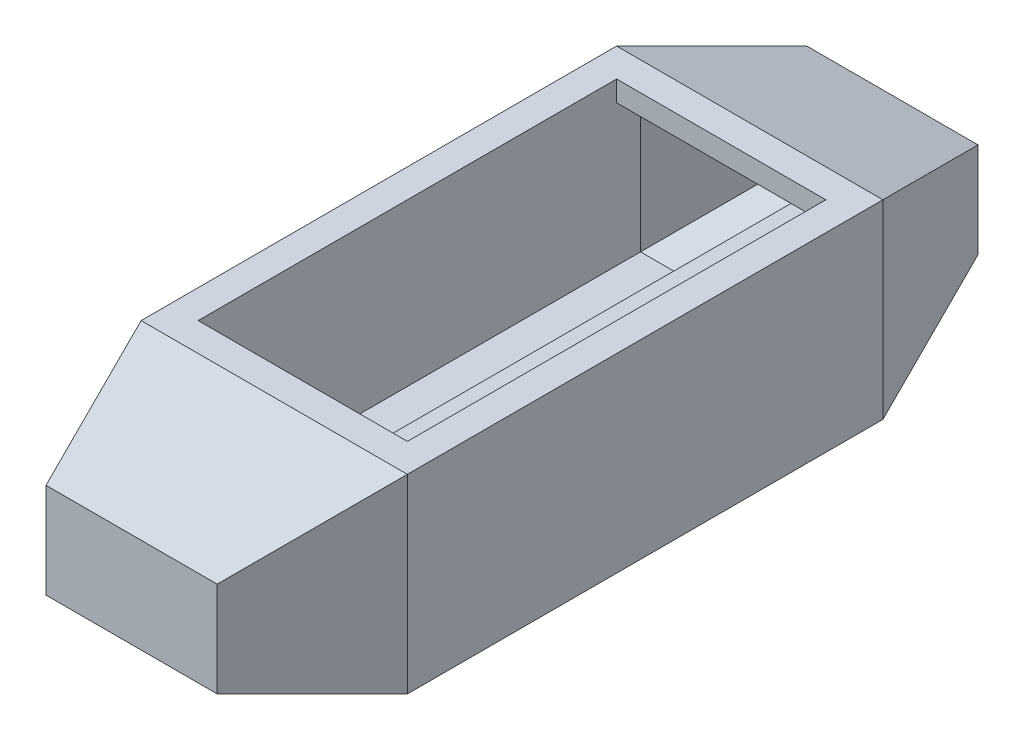
ISO-10303-21;
HEADER;
FILE_DESCRIPTION(('STEP AP214'),'2;1');
FILE_NAME('part.step','',(''),(''),'','','');
FILE_SCHEMA(('AUTOMOTIVE_DESIGN { 1 0 10303 214 1 1 1 1 }'));
ENDSEC;
DATA;
#1=APPLICATION_CONTEXT('core data for automotive mechanical design processes');
#2=APPLICATION_PROTOCOL_DEFINITION('international standard','automotive_design',2000,#1);
#3=PRODUCT_CONTEXT('',#1,'mechanical');
#4=PRODUCT('Part','Part','',(#3));
#5=PRODUCT_RELATED_PRODUCT_CATEGORY('part','',(#4));
#6=PRODUCT_DEFINITION_FORMATION('','',#4);
#7=PRODUCT_DEFINITION_CONTEXT('part definition',#1,'design');
#8=PRODUCT_DEFINITION('design','',#6,#7);
#9=PRODUCT_DEFINITION_SHAPE('','',#8);
#10=(LENGTH_UNIT() NAMED_UNIT(*) SI_UNIT(.MILLI.,.METRE.));
#11=(NAMED_UNIT(*) PLANE_ANGLE_UNIT() SI_UNIT($,.RADIAN.));
#12=(NAMED_UNIT(*) SI_UNIT($,.STERADIAN.) SOLID_ANGLE_UNIT());
#13=UNCERTAINTY_MEASURE_WITH_UNIT(LENGTH_MEASURE(1.E-05),#10,'distance_accuracy_value','');
#14=(GEOMETRIC_REPRESENTATION_CONTEXT(3) GLOBAL_UNCERTAINTY_ASSIGNED_CONTEXT((#13)) GLOBAL_UNIT_ASSIGNED_CONTEXT((#10,
#11,#12)) REPRESENTATION_CONTEXT('',''));
#15=CARTESIAN_POINT('',(0.,0.,0.));
#16=DIRECTION('',(0.,0.,1.));
#17=DIRECTION('',(1.,0.,0.));
#18=AXIS2_PLACEMENT_3D('',#15,#16,#17);
#19=CARTESIAN_POINT('',(-14.,10.,12.5));
#20=DIRECTION('',(0.,-1.,0.));
#21=DIRECTION('',(0.,0.,-1.));
#22=AXIS2_PLACEMENT_3D('',#19,#20,#21);
#23=PLANE('',#22);
#24=DIRECTION('',(0.,0.,-1.));
#25=VECTOR('',#24,1.);
#26=CARTESIAN_POINT('',(14.,10.,12.5));
#27=LINE('',#26,#25);
#28=CARTESIAN_POINT('',(14.,10.000000000006,12.500000000001));
#29=VERTEX_POINT('',#28);
#30=CARTESIAN_POINT('',(14.,10.000000000006,-37.500000000001));
#31=VERTEX_POINT('',#30);
#32=EDGE_CURVE('E673',#29,#31,#27,.T.);
#33=ORIENTED_EDGE('',*,*,#32,.T.);
#34=DIRECTION('',(1.,4.25932437468547E-13,-1.41977479156338E-13));
#35=VECTOR('',#34,1.);
#36=CARTESIAN_POINT('',(-6.03404286414252E-12,10.000000000006,-37.500000000002));
#37=LINE('',#36,#35);
#38=CARTESIAN_POINT('',(-13.9999999999997,10.,-37.5));
#39=VERTEX_POINT('',#38);
#40=EDGE_CURVE('E466',#31,#39,#37,.F.);
#41=ORIENTED_EDGE('',*,*,#40,.T.);
#42=DIRECTION('',(0.,0.,-1.));
#43=VECTOR('',#42,1.);
#44=CARTESIAN_POINT('',(-14.,10.,12.5));
#45=LINE('',#44,#43);
#46=CARTESIAN_POINT('',(-13.9999999999997,10.,12.5));
#47=VERTEX_POINT('',#46);
#48=EDGE_CURVE('E677',#47,#39,#45,.T.);
#49=ORIENTED_EDGE('',*,*,#48,.F.);
#50=DIRECTION('',(1.,4.25932437468547E-13,1.41977479156338E-13));
#51=VECTOR('',#50,1.);
#52=CARTESIAN_POINT('',(-6.03404286414252E-12,10.000000000006,12.500000000002));
#53=LINE('',#52,#51);
#54=EDGE_CURVE('E471',#29,#47,#53,.F.);
#55=ORIENTED_EDGE('',*,*,#54,.F.);
#56=EDGE_LOOP('',(#33,#41,#49,#55));
#57=FACE_BOUND('',#56,.T.);
#58=DIRECTION('',(0.,0.,-1.));
#59=VECTOR('',#58,1.);
#60=CARTESIAN_POINT('',(-11.,10.,12.5));
#61=LINE('',#60,#59);
#62=CARTESIAN_POINT('',(-11.,10.,9.500000000001));
#63=VERTEX_POINT('',#62);
#64=CARTESIAN_POINT('',(-11.,10.,-34.500000000001));
#65=VERTEX_POINT('',#64);
#66=EDGE_CURVE('E238',#63,#65,#61,.T.);
#67=ORIENTED_EDGE('',*,*,#66,.T.);
#68=DIRECTION('',(-1.,0.,0.));
#69=VECTOR('',#68,1.);
#70=CARTESIAN_POINT('',(11.,10.,-34.500000000001));
#71=LINE('',#70,#69);
#72=CARTESIAN_POINT('',(11.,10.,-34.500000000001));
#73=VERTEX_POINT('',#72);
#74=EDGE_CURVE('E236',#73,#65,#71,.T.);
#75=ORIENTED_EDGE('',*,*,#74,.F.);
#76=DIRECTION('',(0.,0.,-1.));
#77=VECTOR('',#76,1.);
#78=CARTESIAN_POINT('',(11.,10.,12.5));
#79=LINE('',#78,#77);
#80=CARTESIAN_POINT('',(11.,10.,9.500000000001));
#81=VERTEX_POINT('',#80);
#82=EDGE_CURVE('E231',#81,#73,#79,.T.);
#83=ORIENTED_EDGE('',*,*,#82,.F.);
#84=DIRECTION('',(1.,0.,0.));
#85=VECTOR('',#84,1.);
#86=CARTESIAN_POINT('',(11.,10.,9.500000000001));
#87=LINE('',#86,#85);
#88=EDGE_CURVE('E234',#63,#81,#87,.T.);
#89=ORIENTED_EDGE('',*,*,#88,.F.);
#90=EDGE_LOOP('',(#67,#75,#83,#89));
#91=FACE_BOUND('',#90,.T.);
#92=ADVANCED_FACE('F43',(#57,#91),#23,.F.);
#93=CARTESIAN_POINT('',(-14.,-10.,12.5));
#94=DIRECTION('',(0.,1.,0.));
#95=DIRECTION('',(0.,0.,1.));
#96=AXIS2_PLACEMENT_3D('',#93,#94,#95);
#97=PLANE('',#96);
#98=DIRECTION('',(1.,-4.25816789236066E-13,-1.41938929745199E-13));
#99=VECTOR('',#98,1.);
#100=CARTESIAN_POINT('',(-6.03240451417282E-12,-9.99999999999404,-37.499999999998));
#101=LINE('',#100,#99);
#102=CARTESIAN_POINT('',(-14.,-9.99999999999404,-37.499999999999));
#103=VERTEX_POINT('',#102);
#104=CARTESIAN_POINT('',(-1.49999999999999,-10.,-37.4999999999801));
#105=VERTEX_POINT('',#104);
#106=EDGE_CURVE('E643',#103,#105,#101,.T.);
#107=ORIENTED_EDGE('',*,*,#106,.T.);
#108=DIRECTION('',(0.,0.,-1.));
#109=VECTOR('',#108,1.);
#110=CARTESIAN_POINT('',(-1.5,-10.,27.4999999999876));
#111=LINE('',#110,#109);
#112=CARTESIAN_POINT('',(-1.5,-10.,12.4999999999801));
#113=VERTEX_POINT('',#112);
#114=EDGE_CURVE('E365',#113,#105,#111,.T.);
#115=ORIENTED_EDGE('',*,*,#114,.F.);
#116=DIRECTION('',(1.,-4.25816789236066E-13,1.41938929745199E-13));
#117=VECTOR('',#116,1.);
#118=CARTESIAN_POINT('',(-6.03240451417282E-12,-9.99999999999404,12.499999999998));
#119=LINE('',#118,#117);
#120=CARTESIAN_POINT('',(-14.,-9.99999999999404,12.499999999999));
#121=VERTEX_POINT('',#120);
#122=EDGE_CURVE('E501',#121,#113,#119,.T.);
#123=ORIENTED_EDGE('',*,*,#122,.F.);
#124=DIRECTION('',(0.,0.,-1.));
#125=VECTOR('',#124,1.);
#126=CARTESIAN_POINT('',(-14.,-10.,12.5));
#127=LINE('',#126,#125);
#128=EDGE_CURVE('E672',#121,#103,#127,.T.);
#129=ORIENTED_EDGE('',*,*,#128,.T.);
#130=EDGE_LOOP('',(#107,#115,#123,#129));
#131=FACE_BOUND('',#130,.T.);
#132=ADVANCED_FACE('F683',(#131),#97,.F.);
#133=CARTESIAN_POINT('',(-6.03240451417282E-12,-12.7499999999927,4.2499999999929));
#134=DIRECTION('',(4.48850306641896E-13,0.948683298050618,-0.316227766016525));
#135=DIRECTION('',(0.,0.316227766016525,0.948683298050618));
#136=AXIS2_PLACEMENT_3D('',#133,#134,#135);
#137=PLANE('',#136);
#138=ORIENTED_EDGE('',*,*,#122,.T.);
#139=DIRECTION('',(0.,0.316227766016525,0.948683298050618));
#140=VECTOR('',#139,1.);
#141=CARTESIAN_POINT('',(-1.5,-12.7499999999921,4.24999999999268));
#142=LINE('',#141,#140);
#143=CARTESIAN_POINT('',(-1.5,-5.,27.4999999999876));
#144=VERTEX_POINT('',#143);
#145=EDGE_CURVE('E376',#113,#144,#142,.T.);
#146=ORIENTED_EDGE('',*,*,#145,.T.);
#147=DIRECTION('',(1.,0.,1.4193892974548E-12));
#148=VECTOR('',#147,1.);
#149=CARTESIAN_POINT('',(-9.0000000000213,-4.99999999999874,27.4999999999876));
#150=LINE('',#149,#148);
#151=CARTESIAN_POINT('',(-9.0000000000213,-4.99999999999874,27.4999999999876));
#152=VERTEX_POINT('',#151);
#153=EDGE_CURVE('E385',#152,#144,#150,.T.);
#154=ORIENTED_EDGE('',*,*,#153,.F.);
#155=DIRECTION('',(0.301511344576792,0.301511344578153,0.904534033733485));
#156=VECTOR('',#155,1.);
#157=CARTESIAN_POINT('',(-14.,-10.,12.5));
#158=LINE('',#157,#156);
#159=EDGE_CURVE('E465',#121,#152,#158,.T.);
#160=ORIENTED_EDGE('',*,*,#159,.F.);
#161=EDGE_LOOP('',(#138,#146,#154,#160));
#162=FACE_BOUND('',#161,.T.);
#163=ADVANCED_FACE('F721',(#162),#137,.F.);
#164=CARTESIAN_POINT('',(-6.03240451417282E-12,-12.7499999999927,-29.2499999999929));
#165=DIRECTION('',(4.48850306641896E-13,0.948683298050618,0.316227766016525));
#166=DIRECTION('',(0.,0.316227766016525,-0.948683298050618));
#167=AXIS2_PLACEMENT_3D('',#164,#165,#166);
#168=PLANE('',#167);
#169=DIRECTION('',(1.,0.,-1.4193892974548E-12));
#170=VECTOR('',#169,1.);
#171=CARTESIAN_POINT('',(-9.0000000000213,-4.99999999999874,-52.4999999999877));
#172=LINE('',#171,#170);
#173=CARTESIAN_POINT('',(-9.0000000000213,-4.99999999999874,-52.4999999999877));
#174=VERTEX_POINT('',#173);
#175=CARTESIAN_POINT('',(-1.5,-5.00000000000033,-52.4999999999935));
#176=VERTEX_POINT('',#175);
#177=EDGE_CURVE('E597',#174,#176,#172,.T.);
#178=ORIENTED_EDGE('',*,*,#177,.T.);
#179=DIRECTION('',(0.,-0.316227766016525,0.948683298050618));
#180=VECTOR('',#179,1.);
#181=CARTESIAN_POINT('',(-1.49999999999999,-12.7499999999921,-29.2499999999927));
#182=LINE('',#181,#180);
#183=EDGE_CURVE('E12',#176,#105,#182,.T.);
#184=ORIENTED_EDGE('',*,*,#183,.T.);
#185=ORIENTED_EDGE('',*,*,#106,.F.);
#186=DIRECTION('',(0.301511344576792,0.301511344578153,-0.904534033733485));
#187=VECTOR('',#186,1.);
#188=CARTESIAN_POINT('',(-14.,-10.,-37.5));
#189=LINE('',#188,#187);
#190=EDGE_CURVE('E587',#103,#174,#189,.T.);
#191=ORIENTED_EDGE('',*,*,#190,.T.);
#192=EDGE_LOOP('',(#178,#184,#185,#191));
#193=FACE_BOUND('',#192,.T.);
#194=ADVANCED_FACE('F680',(#193),#168,.F.);
#195=CARTESIAN_POINT('',(-14.,10.,12.5));
#196=DIRECTION('',(1.,0.,0.));
#197=DIRECTION('',(0.,0.,-1.));
#198=AXIS2_PLACEMENT_3D('',#195,#196,#197);
#199=PLANE('',#198);
#200=ORIENTED_EDGE('',*,*,#48,.T.);
#201=DIRECTION('',(0.,1.,0.));
#202=VECTOR('',#201,1.);
#203=CARTESIAN_POINT('',(-13.9999999999997,4.61367055669139E-13,-37.4999999999999));
#204=LINE('',#203,#202);
#205=EDGE_CURVE('E586',#39,#103,#204,.F.);
#206=ORIENTED_EDGE('',*,*,#205,.T.);
#207=ORIENTED_EDGE('',*,*,#128,.F.);
#208=DIRECTION('',(0.,1.,0.));
#209=VECTOR('',#208,1.);
#210=CARTESIAN_POINT('',(-13.9999999999997,4.61367055669139E-13,12.4999999999999));
#211=LINE('',#210,#209);
#212=EDGE_CURVE('E486',#47,#121,#211,.F.);
#213=ORIENTED_EDGE('',*,*,#212,.F.);
#214=EDGE_LOOP('',(#200,#206,#207,#213));
#215=FACE_BOUND('',#214,.T.);
#216=ADVANCED_FACE('F45',(#215),#199,.F.);
#217=CARTESIAN_POINT('',(1.5,-10.,12.4999999999801));
#218=VERTEX_POINT('',#217);
#219=CARTESIAN_POINT('',(14.0000000000003,-10.,12.5));
#220=VERTEX_POINT('',#219);
#221=EDGE_CURVE('E498',#218,#220,#119,.T.);
#222=ORIENTED_EDGE('',*,*,#221,.F.);
#223=DIRECTION('',(0.,0.,1.));
#224=VECTOR('',#223,1.);
#225=CARTESIAN_POINT('',(1.5,-10.,27.4999999999876));
#226=LINE('',#225,#224);
#227=CARTESIAN_POINT('',(1.49999999999999,-10.,-37.4999999999801));
#228=VERTEX_POINT('',#227);
#229=EDGE_CURVE('E369',#228,#218,#226,.T.);
#230=ORIENTED_EDGE('',*,*,#229,.F.);
#231=CARTESIAN_POINT('',(14.0000000000003,-10.,-37.5));
#232=VERTEX_POINT('',#231);
#233=EDGE_CURVE('E652',#228,#232,#101,.T.);
#234=ORIENTED_EDGE('',*,*,#233,.T.);
#235=DIRECTION('',(0.,0.,-1.));
#236=VECTOR('',#235,1.);
#237=CARTESIAN_POINT('',(14.,-10.,12.5));
#238=LINE('',#237,#236);
#239=EDGE_CURVE('E666',#220,#232,#238,.T.);
#240=ORIENTED_EDGE('',*,*,#239,.F.);
#241=EDGE_LOOP('',(#222,#230,#234,#240));
#242=FACE_BOUND('',#241,.T.);
#243=ADVANCED_FACE('F665',(#242),#97,.F.);
#244=CARTESIAN_POINT('',(14.,10.,12.5));
#245=DIRECTION('',(-1.,0.,0.));
#246=DIRECTION('',(0.,-1.,0.));
#247=AXIS2_PLACEMENT_3D('',#244,#245,#246);
#248=PLANE('',#247);
#249=ORIENTED_EDGE('',*,*,#239,.T.);
#250=DIRECTION('',(0.,1.,0.));
#251=VECTOR('',#250,1.);
#252=CARTESIAN_POINT('',(14.0000000000003,4.575853584948E-13,-37.5000000000001));
#253=LINE('',#252,#251);
#254=EDGE_CURVE('E651',#232,#31,#253,.T.);
#255=ORIENTED_EDGE('',*,*,#254,.T.);
#256=ORIENTED_EDGE('',*,*,#32,.F.);
#257=DIRECTION('',(0.,1.,0.));
#258=VECTOR('',#257,1.);
#259=CARTESIAN_POINT('',(14.0000000000003,4.575853584948E-13,12.5000000000001));
#260=LINE('',#259,#258);
#261=EDGE_CURVE('E671',#220,#29,#260,.T.);
#262=ORIENTED_EDGE('',*,*,#261,.F.);
#263=EDGE_LOOP('',(#249,#255,#256,#262));
#264=FACE_BOUND('',#263,.T.);
#265=ADVANCED_FACE('F418',(#264),#248,.F.);
#266=CARTESIAN_POINT('',(-3.9033205680007E-11,2.32799890476087E-12,27.5));
#267=DIRECTION('',(-1.4193892974548E-12,0.,1.));
#268=DIRECTION('',(1.,0.,1.4193892974548E-12));
#269=AXIS2_PLACEMENT_3D('',#266,#267,#268);
#270=PLANE('',#269);
#271=DIRECTION('',(0.,-1.,0.));
#272=VECTOR('',#271,1.);
#273=CARTESIAN_POINT('',(-9.0000000000213,5.00000000000127,27.4999999999868));
#274=LINE('',#273,#272);
#275=CARTESIAN_POINT('',(-9.0000000000213,5.00000000000127,27.4999999999868));
#276=VERTEX_POINT('',#275);
#277=EDGE_CURVE('E453',#276,#152,#274,.T.);
#278=ORIENTED_EDGE('',*,*,#277,.T.);
#279=ORIENTED_EDGE('',*,*,#153,.T.);
#280=DIRECTION('',(1.,0.,0.));
#281=VECTOR('',#280,1.);
#282=CARTESIAN_POINT('',(0.,-5.,27.4999999999876));
#283=LINE('',#282,#281);
#284=CARTESIAN_POINT('',(1.5,-5.,27.4999999999876));
#285=VERTEX_POINT('',#284);
#286=EDGE_CURVE('E726',#285,#144,#283,.F.);
#287=ORIENTED_EDGE('',*,*,#286,.F.);
#288=CARTESIAN_POINT('',(8.9999999999787,-4.99999999999874,27.5000000000132));
#289=VERTEX_POINT('',#288);
#290=EDGE_CURVE('E382',#285,#289,#150,.T.);
#291=ORIENTED_EDGE('',*,*,#290,.T.);
#292=DIRECTION('',(0.,1.,0.));
#293=VECTOR('',#292,1.);
#294=CARTESIAN_POINT('',(8.9999999999787,5.00000000000127,27.5000000000124));
#295=LINE('',#294,#293);
#296=CARTESIAN_POINT('',(8.9999999999787,5.00000000000127,27.5000000000124));
#297=VERTEX_POINT('',#296);
#298=EDGE_CURVE('E388',#289,#297,#295,.T.);
#299=ORIENTED_EDGE('',*,*,#298,.T.);
#300=DIRECTION('',(-1.,0.,-1.41977479156057E-12));
#301=VECTOR('',#300,1.);
#302=CARTESIAN_POINT('',(-9.0000000000213,5.00000000000127,27.4999999999868));
#303=LINE('',#302,#301);
#304=EDGE_CURVE('E443',#297,#276,#303,.T.);
#305=ORIENTED_EDGE('',*,*,#304,.T.);
#306=EDGE_LOOP('',(#278,#279,#287,#291,#299,#305));
#307=FACE_BOUND('',#306,.T.);
#308=ADVANCED_FACE('F407',(#307),#270,.T.);
#309=CARTESIAN_POINT('',(-6.03404286414252E-12,12.7500000000073,4.2500000000071));
#310=DIRECTION('',(4.48972210582666E-13,-0.94868329805041,-0.316227766017151));
#311=DIRECTION('',(0.,0.316227766017151,-0.94868329805041));
#312=AXIS2_PLACEMENT_3D('',#309,#310,#311);
#313=PLANE('',#312);
#314=DIRECTION('',(0.30151134457682,-0.301511344578028,0.904534033733517));
#315=VECTOR('',#314,1.);
#316=CARTESIAN_POINT('',(-14.,10.,12.5));
#317=LINE('',#316,#315);
#318=EDGE_CURVE('E446',#47,#276,#317,.T.);
#319=ORIENTED_EDGE('',*,*,#318,.T.);
#320=ORIENTED_EDGE('',*,*,#304,.F.);
#321=DIRECTION('',(-0.301511344578735,-0.301511344577374,0.904534033733097));
#322=VECTOR('',#321,1.);
#323=CARTESIAN_POINT('',(14.,10.,12.5));
#324=LINE('',#323,#322);
#325=EDGE_CURVE('E472',#29,#297,#324,.T.);
#326=ORIENTED_EDGE('',*,*,#325,.F.);
#327=ORIENTED_EDGE('',*,*,#54,.T.);
#328=EDGE_LOOP('',(#319,#320,#326,#327));
#329=FACE_BOUND('',#328,.T.);
#330=ADVANCED_FACE('F417',(#329),#313,.F.);
#331=CARTESIAN_POINT('',(16.3500000000019,4.575853584948E-13,5.45000000001952));
#332=DIRECTION('',(-0.948683298050185,0.,-0.316227766017824));
#333=DIRECTION('',(-0.316227766017824,0.,0.948683298050185));
#334=AXIS2_PLACEMENT_3D('',#331,#332,#333);
#335=PLANE('',#334);
#336=ORIENTED_EDGE('',*,*,#325,.T.);
#337=ORIENTED_EDGE('',*,*,#298,.F.);
#338=DIRECTION('',(-0.301511344578707,0.301511344577499,0.904534033733065));
#339=VECTOR('',#338,1.);
#340=CARTESIAN_POINT('',(14.,-10.,12.5));
#341=LINE('',#340,#339);
#342=EDGE_CURVE('E481',#220,#289,#341,.T.);
#343=ORIENTED_EDGE('',*,*,#342,.F.);
#344=ORIENTED_EDGE('',*,*,#261,.T.);
#345=EDGE_LOOP('',(#336,#337,#343,#344));
#346=FACE_BOUND('',#345,.T.);
#347=ADVANCED_FACE('F692',(#346),#335,.F.);
#348=CARTESIAN_POINT('',(-16.3499999999981,4.61367055669139E-13,5.44999999998048));
#349=DIRECTION('',(0.948683298050842,0.,-0.316227766015852));
#350=DIRECTION('',(-0.316227766015852,0.,-0.948683298050843));
#351=AXIS2_PLACEMENT_3D('',#348,#349,#350);
#352=PLANE('',#351);
#353=ORIENTED_EDGE('',*,*,#159,.T.);
#354=ORIENTED_EDGE('',*,*,#277,.F.);
#355=ORIENTED_EDGE('',*,*,#318,.F.);
#356=ORIENTED_EDGE('',*,*,#212,.T.);
#357=EDGE_LOOP('',(#353,#354,#355,#356));
#358=FACE_BOUND('',#357,.T.);
#359=ADVANCED_FACE('F462',(#358),#352,.F.);
#360=ORIENTED_EDGE('',*,*,#290,.F.);
#361=DIRECTION('',(0.,-0.316227766016525,-0.948683298050618));
#362=VECTOR('',#361,1.);
#363=CARTESIAN_POINT('',(1.5,-12.7499999999934,4.24999999999311));
#364=LINE('',#363,#362);
#365=EDGE_CURVE('E381',#285,#218,#364,.T.);
#366=ORIENTED_EDGE('',*,*,#365,.T.);
#367=ORIENTED_EDGE('',*,*,#221,.T.);
#368=ORIENTED_EDGE('',*,*,#342,.T.);
#369=EDGE_LOOP('',(#360,#366,#367,#368));
#370=FACE_BOUND('',#369,.T.);
#371=ADVANCED_FACE('F619',(#370),#137,.F.);
#372=CARTESIAN_POINT('',(-3.9033205680007E-11,2.32799890476087E-12,-52.5));
#373=DIRECTION('',(-1.4193892974548E-12,0.,-1.));
#374=DIRECTION('',(1.,0.,-1.4193892974548E-12));
#375=AXIS2_PLACEMENT_3D('',#372,#373,#374);
#376=PLANE('',#375);
#377=DIRECTION('',(0.,-1.,0.));
#378=VECTOR('',#377,1.);
#379=CARTESIAN_POINT('',(-9.0000000000213,5.00000000000127,-52.4999999999868));
#380=LINE('',#379,#378);
#381=CARTESIAN_POINT('',(-9.0000000000213,5.00000000000127,-52.4999999999868));
#382=VERTEX_POINT('',#381);
#383=EDGE_CURVE('E380',#382,#174,#380,.T.);
#384=ORIENTED_EDGE('',*,*,#383,.F.);
#385=DIRECTION('',(-1.,0.,1.41977479156057E-12));
#386=VECTOR('',#385,1.);
#387=CARTESIAN_POINT('',(-9.0000000000213,5.00000000000127,-52.4999999999868));
#388=LINE('',#387,#386);
#389=CARTESIAN_POINT('',(8.9999999999787,5.00000000000127,-52.5000000000124));
#390=VERTEX_POINT('',#389);
#391=EDGE_CURVE('E581',#390,#382,#388,.T.);
#392=ORIENTED_EDGE('',*,*,#391,.F.);
#393=DIRECTION('',(0.,1.,0.));
#394=VECTOR('',#393,1.);
#395=CARTESIAN_POINT('',(8.9999999999787,5.00000000000127,-52.5000000000124));
#396=LINE('',#395,#394);
#397=CARTESIAN_POINT('',(8.9999999999787,-4.99999999999874,-52.5000000000132));
#398=VERTEX_POINT('',#397);
#399=EDGE_CURVE('E533',#398,#390,#396,.T.);
#400=ORIENTED_EDGE('',*,*,#399,.F.);
#401=CARTESIAN_POINT('',(1.49999999999999,-5.,-52.4999999999877));
#402=VERTEX_POINT('',#401);
#403=EDGE_CURVE('E512',#402,#398,#172,.T.);
#404=ORIENTED_EDGE('',*,*,#403,.F.);
#405=DIRECTION('',(1.,0.,0.));
#406=VECTOR('',#405,1.);
#407=CARTESIAN_POINT('',(0.,-5.,-52.4999999999877));
#408=LINE('',#407,#406);
#409=EDGE_CURVE('E389',#176,#402,#408,.T.);
#410=ORIENTED_EDGE('',*,*,#409,.F.);
#411=ORIENTED_EDGE('',*,*,#177,.F.);
#412=EDGE_LOOP('',(#384,#392,#400,#404,#410,#411));
#413=FACE_BOUND('',#412,.T.);
#414=ADVANCED_FACE('F610',(#413),#376,.T.);
#415=CARTESIAN_POINT('',(-6.03404286414252E-12,12.7500000000073,-29.2500000000071));
#416=DIRECTION('',(4.48972210582666E-13,-0.94868329805041,0.316227766017151));
#417=DIRECTION('',(0.,0.316227766017151,0.94868329805041));
#418=AXIS2_PLACEMENT_3D('',#415,#416,#417);
#419=PLANE('',#418);
#420=DIRECTION('',(0.30151134457682,-0.301511344578028,-0.904534033733517));
#421=VECTOR('',#420,1.);
#422=CARTESIAN_POINT('',(-14.,10.,-37.5));
#423=LINE('',#422,#421);
#424=EDGE_CURVE('E593',#39,#382,#423,.T.);
#425=ORIENTED_EDGE('',*,*,#424,.F.);
#426=ORIENTED_EDGE('',*,*,#40,.F.);
#427=DIRECTION('',(-0.301511344578735,-0.301511344577374,-0.904534033733097));
#428=VECTOR('',#427,1.);
#429=CARTESIAN_POINT('',(14.,10.,-37.5));
#430=LINE('',#429,#428);
#431=EDGE_CURVE('E373',#31,#390,#430,.T.);
#432=ORIENTED_EDGE('',*,*,#431,.T.);
#433=ORIENTED_EDGE('',*,*,#391,.T.);
#434=EDGE_LOOP('',(#425,#426,#432,#433));
#435=FACE_BOUND('',#434,.T.);
#436=ADVANCED_FACE('F551',(#435),#419,.F.);
#437=CARTESIAN_POINT('',(16.3500000000019,4.575853584948E-13,-30.4500000000195));
#438=DIRECTION('',(-0.948683298050185,0.,0.316227766017824));
#439=DIRECTION('',(-0.316227766017824,0.,-0.948683298050185));
#440=AXIS2_PLACEMENT_3D('',#437,#438,#439);
#441=PLANE('',#440);
#442=ORIENTED_EDGE('',*,*,#431,.F.);
#443=ORIENTED_EDGE('',*,*,#254,.F.);
#444=DIRECTION('',(-0.301511344578707,0.301511344577499,-0.904534033733065));
#445=VECTOR('',#444,1.);
#446=CARTESIAN_POINT('',(14.,-10.,-37.5));
#447=LINE('',#446,#445);
#448=EDGE_CURVE('E584',#232,#398,#447,.T.);
#449=ORIENTED_EDGE('',*,*,#448,.T.);
#450=ORIENTED_EDGE('',*,*,#399,.T.);
#451=EDGE_LOOP('',(#442,#443,#449,#450));
#452=FACE_BOUND('',#451,.T.);
#453=ADVANCED_FACE('F541',(#452),#441,.F.);
#454=CARTESIAN_POINT('',(-16.3499999999981,4.61367055669139E-13,-30.4499999999805));
#455=DIRECTION('',(0.948683298050842,0.,0.316227766015852));
#456=DIRECTION('',(-0.316227766015852,0.,0.948683298050843));
#457=AXIS2_PLACEMENT_3D('',#454,#455,#456);
#458=PLANE('',#457);
#459=ORIENTED_EDGE('',*,*,#190,.F.);
#460=ORIENTED_EDGE('',*,*,#205,.F.);
#461=ORIENTED_EDGE('',*,*,#424,.T.);
#462=ORIENTED_EDGE('',*,*,#383,.T.);
#463=EDGE_LOOP('',(#459,#460,#461,#462));
#464=FACE_BOUND('',#463,.T.);
#465=ADVANCED_FACE('F550',(#464),#458,.F.);
#466=ORIENTED_EDGE('',*,*,#233,.F.);
#467=DIRECTION('',(0.,0.316227766016525,-0.948683298050618));
#468=VECTOR('',#467,1.);
#469=CARTESIAN_POINT('',(1.49999999999999,-12.7499999999934,-29.2499999999931));
#470=LINE('',#469,#468);
#471=EDGE_CURVE('E52',#228,#402,#470,.T.);
#472=ORIENTED_EDGE('',*,*,#471,.T.);
#473=ORIENTED_EDGE('',*,*,#403,.T.);
#474=ORIENTED_EDGE('',*,*,#448,.F.);
#475=EDGE_LOOP('',(#466,#472,#473,#474));
#476=FACE_BOUND('',#475,.T.);
#477=ADVANCED_FACE('F419',(#476),#168,.F.);
#478=CARTESIAN_POINT('',(-1.5,-5.,27.4999999999876));
#479=DIRECTION('',(-1.,0.,0.));
#480=DIRECTION('',(0.,0.,1.));
#481=AXIS2_PLACEMENT_3D('',#478,#479,#480);
#482=PLANE('',#481);
#483=ORIENTED_EDGE('',*,*,#114,.T.);
#484=ORIENTED_EDGE('',*,*,#183,.F.);
#485=DIRECTION('',(0.,0.,-1.));
#486=VECTOR('',#485,1.);
#487=CARTESIAN_POINT('',(-1.5,-5.,27.4999999999876));
#488=LINE('',#487,#486);
#489=EDGE_CURVE('E68',#144,#176,#488,.T.);
#490=ORIENTED_EDGE('',*,*,#489,.F.);
#491=ORIENTED_EDGE('',*,*,#145,.F.);
#492=EDGE_LOOP('',(#483,#484,#490,#491));
#493=FACE_BOUND('',#492,.T.);
#494=ADVANCED_FACE('F620',(#493),#482,.F.);
#495=CARTESIAN_POINT('',(1.5,-5.,27.4999999999876));
#496=DIRECTION('',(1.,0.,0.));
#497=DIRECTION('',(0.,0.,-1.));
#498=AXIS2_PLACEMENT_3D('',#495,#496,#497);
#499=PLANE('',#498);
#500=DIRECTION('',(0.,0.,1.));
#501=VECTOR('',#500,1.);
#502=CARTESIAN_POINT('',(1.5,-5.,27.4999999999876));
#503=LINE('',#502,#501);
#504=EDGE_CURVE('E728',#402,#285,#503,.T.);
#505=ORIENTED_EDGE('',*,*,#504,.F.);
#506=ORIENTED_EDGE('',*,*,#471,.F.);
#507=ORIENTED_EDGE('',*,*,#229,.T.);
#508=ORIENTED_EDGE('',*,*,#365,.F.);
#509=EDGE_LOOP('',(#505,#506,#507,#508));
#510=FACE_BOUND('',#509,.T.);
#511=ADVANCED_FACE('F742',(#510),#499,.F.);
#512=CARTESIAN_POINT('',(0.,-5.,0.));
#513=DIRECTION('',(0.,-1.,0.));
#514=DIRECTION('',(0.,0.,-1.));
#515=AXIS2_PLACEMENT_3D('',#512,#513,#514);
#516=PLANE('',#515);
#517=ORIENTED_EDGE('',*,*,#489,.T.);
#518=ORIENTED_EDGE('',*,*,#409,.T.);
#519=ORIENTED_EDGE('',*,*,#504,.T.);
#520=ORIENTED_EDGE('',*,*,#286,.T.);
#521=EDGE_LOOP('',(#517,#518,#519,#520));
#522=FACE_BOUND('',#521,.T.);
#523=ADVANCED_FACE('F727',(#522),#516,.T.);
#524=CARTESIAN_POINT('',(-14.,-7.,12.5));
#525=DIRECTION('',(0.,1.,0.));
#526=DIRECTION('',(0.,0.,1.));
#527=AXIS2_PLACEMENT_3D('',#524,#525,#526);
#528=PLANE('',#527);
#529=DIRECTION('',(1.,0.,-1.4193892974548E-12));
#530=VECTOR('',#529,1.);
#531=CARTESIAN_POINT('',(-14.0000000000703,-7.,-37.0131670194556));
#532=LINE('',#531,#530);
#533=CARTESIAN_POINT('',(-11.0000000000061,-6.99999999999395,-37.013167019478));
#534=VERTEX_POINT('',#533);
#535=CARTESIAN_POINT('',(-3.49999999999999,-7.,-37.0131670194705));
#536=VERTEX_POINT('',#535);
#537=EDGE_CURVE('E265',#534,#536,#532,.T.);
#538=ORIENTED_EDGE('',*,*,#537,.F.);
#539=DIRECTION('',(0.,0.,-1.));
#540=VECTOR('',#539,1.);
#541=CARTESIAN_POINT('',(-11.,-7.,12.5));
#542=LINE('',#541,#540);
#543=CARTESIAN_POINT('',(-11.0000000000061,-6.99999999999395,12.013167019478));
#544=VERTEX_POINT('',#543);
#545=EDGE_CURVE('E277',#544,#534,#542,.T.);
#546=ORIENTED_EDGE('',*,*,#545,.F.);
#547=DIRECTION('',(1.,0.,1.4193892974548E-12));
#548=VECTOR('',#547,1.);
#549=CARTESIAN_POINT('',(-1.70513606959805E-11,-7.,12.0131670194755));
#550=LINE('',#549,#548);
#551=CARTESIAN_POINT('',(-3.5,-7.,12.0131670194705));
#552=VERTEX_POINT('',#551);
#553=EDGE_CURVE('E272',#544,#552,#550,.T.);
#554=ORIENTED_EDGE('',*,*,#553,.T.);
#555=DIRECTION('',(0.,0.,-1.));
#556=VECTOR('',#555,1.);
#557=CARTESIAN_POINT('',(-3.5,-7.,27.4999999999876));
#558=LINE('',#557,#556);
#559=EDGE_CURVE('E264',#552,#536,#558,.T.);
#560=ORIENTED_EDGE('',*,*,#559,.T.);
#561=EDGE_LOOP('',(#538,#546,#554,#560));
#562=FACE_BOUND('',#561,.T.);
#563=ADVANCED_FACE('F779',(#562),#528,.T.);
#564=CARTESIAN_POINT('',(-4.68585359424713E-12,-9.90395010584086,3.30131670194332));
#565=DIRECTION('',(4.48850306641896E-13,0.948683298050618,-0.316227766016525));
#566=DIRECTION('',(0.,0.316227766016525,0.948683298050618));
#567=AXIS2_PLACEMENT_3D('',#564,#565,#566);
#568=PLANE('',#567);
#569=ORIENTED_EDGE('',*,*,#553,.F.);
#570=DIRECTION('',(0.301511344576865,0.301511344577427,0.904534033733703));
#571=VECTOR('',#570,1.);
#572=CARTESIAN_POINT('',(-12.6399546416822,-8.63995464167313,7.09330309443276));
#573=LINE('',#572,#571);
#574=CARTESIAN_POINT('',(-6.83772233984952,-2.83772233982966,24.4999999999905));
#575=VERTEX_POINT('',#574);
#576=EDGE_CURVE('E289',#544,#575,#573,.T.);
#577=ORIENTED_EDGE('',*,*,#576,.T.);
#578=DIRECTION('',(1.,0.,1.4193892974548E-12));
#579=VECTOR('',#578,1.);
#580=CARTESIAN_POINT('',(-3.4775037787643E-11,-2.83772233982966,24.5000000000002));
#581=LINE('',#580,#579);
#582=CARTESIAN_POINT('',(6.83772233981372,-2.83772233982966,24.5000000000099));
#583=VERTEX_POINT('',#582);
#584=EDGE_CURVE('E285',#575,#583,#581,.T.);
#585=ORIENTED_EDGE('',*,*,#584,.T.);
#586=DIRECTION('',(-0.301511344578738,0.301511344577496,0.904534033733055));
#587=VECTOR('',#586,1.);
#588=CARTESIAN_POINT('',(12.6399546416823,-8.63995464167431,7.0933030944651));
#589=LINE('',#588,#587);
#590=CARTESIAN_POINT('',(11.0000000000006,-6.9999999999994,12.0131670194929));
#591=VERTEX_POINT('',#590);
#592=EDGE_CURVE('E292',#591,#583,#589,.T.);
#593=ORIENTED_EDGE('',*,*,#592,.F.);
#594=DIRECTION('',(1.,0.,1.4193892974548E-12));
#595=VECTOR('',#594,1.);
#596=CARTESIAN_POINT('',(-1.70513606959805E-11,-7.,12.0131670194755));
#597=LINE('',#596,#595);
#598=CARTESIAN_POINT('',(3.5,-7.,12.0131670194805));
#599=VERTEX_POINT('',#598);
#600=EDGE_CURVE('E276',#599,#591,#597,.T.);
#601=ORIENTED_EDGE('',*,*,#600,.F.);
#602=DIRECTION('',(0.,-0.316227766016525,-0.948683298050618));
#603=VECTOR('',#602,1.);
#604=CARTESIAN_POINT('',(3.5,-9.90395010584235,3.30131670194382));
#605=LINE('',#604,#603);
#606=CARTESIAN_POINT('',(3.5,-3.,24.0131670194937));
#607=VERTEX_POINT('',#606);
#608=EDGE_CURVE('E284',#607,#599,#605,.T.);
#609=ORIENTED_EDGE('',*,*,#608,.F.);
#610=DIRECTION('',(-1.,0.,-1.4193892974548E-12));
#611=VECTOR('',#610,1.);
#612=CARTESIAN_POINT('',(-3.40840322654569E-11,-3.,24.0131670194887));
#613=LINE('',#612,#611);
#614=CARTESIAN_POINT('',(-3.5,-3.,24.0131670194837));
#615=VERTEX_POINT('',#614);
#616=EDGE_CURVE('E304',#607,#615,#613,.T.);
#617=ORIENTED_EDGE('',*,*,#616,.T.);
#618=DIRECTION('',(0.,0.316227766016525,0.948683298050618));
#619=VECTOR('',#618,1.);
#620=CARTESIAN_POINT('',(-3.5,-9.90395010583937,3.30131670194283));
#621=LINE('',#620,#619);
#622=EDGE_CURVE('E280',#552,#615,#621,.T.);
#623=ORIENTED_EDGE('',*,*,#622,.F.);
#624=EDGE_LOOP('',(#569,#577,#585,#593,#601,#609,#617,#623));
#625=FACE_BOUND('',#624,.T.);
#626=ADVANCED_FACE('F837',(#625),#568,.T.);
#627=CARTESIAN_POINT('',(-11.,10.,12.5));
#628=DIRECTION('',(1.,0.,0.));
#629=DIRECTION('',(0.,0.,-1.));
#630=AXIS2_PLACEMENT_3D('',#627,#628,#629);
#631=PLANE('',#630);
#632=DIRECTION('',(0.,0.316227766017151,0.94868329805041));
#633=VECTOR('',#632,1.);
#634=CARTESIAN_POINT('',(-11.,9.90395010585137,-28.3013167019541));
#635=LINE('',#634,#633);
#636=CARTESIAN_POINT('',(-11.,7.0000000000012,-37.013167019495));
#637=VERTEX_POINT('',#636);
#638=CARTESIAN_POINT('',(-11.,7.83772233983345,-34.500000000001));
#639=VERTEX_POINT('',#638);
#640=EDGE_CURVE('E359',#637,#639,#635,.T.);
#641=ORIENTED_EDGE('',*,*,#640,.T.);
#642=DIRECTION('',(0.,1.,0.));
#643=VECTOR('',#642,1.);
#644=CARTESIAN_POINT('',(-11.,-52.1934955049972,-34.500000000001));
#645=LINE('',#644,#643);
#646=EDGE_CURVE('E252',#639,#65,#645,.T.);
#647=ORIENTED_EDGE('',*,*,#646,.T.);
#648=ORIENTED_EDGE('',*,*,#66,.F.);
#649=DIRECTION('',(0.,1.,0.));
#650=VECTOR('',#649,1.);
#651=CARTESIAN_POINT('',(-11.,-52.1934955049972,9.500000000001));
#652=LINE('',#651,#650);
#653=CARTESIAN_POINT('',(-11.,7.83772233983867,9.500000000001));
#654=VERTEX_POINT('',#653);
#655=EDGE_CURVE('E247',#654,#63,#652,.T.);
#656=ORIENTED_EDGE('',*,*,#655,.F.);
#657=DIRECTION('',(0.,0.316227766017151,-0.94868329805041));
#658=VECTOR('',#657,1.);
#659=CARTESIAN_POINT('',(-11.,7.15395010585005,11.551316701949));
#660=LINE('',#659,#658);
#661=CARTESIAN_POINT('',(-11.,7.0000000000012,12.013167019495));
#662=VERTEX_POINT('',#661);
#663=EDGE_CURVE('E355',#662,#654,#660,.T.);
#664=ORIENTED_EDGE('',*,*,#663,.F.);
#665=DIRECTION('',(0.,-1.,0.));
#666=VECTOR('',#665,1.);
#667=CARTESIAN_POINT('',(-11.,1.01696871505801E-12,12.0131670194956));
#668=LINE('',#667,#666);
#669=EDGE_CURVE('E298',#662,#544,#668,.T.);
#670=ORIENTED_EDGE('',*,*,#669,.T.);
#671=ORIENTED_EDGE('',*,*,#545,.T.);
#672=DIRECTION('',(0.,-1.,0.));
#673=VECTOR('',#672,1.);
#674=CARTESIAN_POINT('',(-11.,10.0000000000042,-37.0131670194948));
#675=LINE('',#674,#673);
#676=EDGE_CURVE('E294',#637,#534,#675,.T.);
#677=ORIENTED_EDGE('',*,*,#676,.F.);
#678=EDGE_LOOP('',(#641,#647,#648,#656,#664,#670,#671,#677));
#679=FACE_BOUND('',#678,.T.);
#680=ADVANCED_FACE('F834',(#679),#631,.T.);
#681=ORIENTED_EDGE('',*,*,#600,.T.);
#682=DIRECTION('',(0.,0.,-1.));
#683=VECTOR('',#682,1.);
#684=CARTESIAN_POINT('',(11.,-7.,12.5));
#685=LINE('',#684,#683);
#686=CARTESIAN_POINT('',(11.0000000000006,-6.9999999999994,-37.0131670194929));
#687=VERTEX_POINT('',#686);
#688=EDGE_CURVE('E237',#591,#687,#685,.T.);
#689=ORIENTED_EDGE('',*,*,#688,.T.);
#690=DIRECTION('',(1.,0.,-1.4193892974548E-12));
#691=VECTOR('',#690,1.);
#692=CARTESIAN_POINT('',(-14.0000000000703,-7.,-37.0131670194556));
#693=LINE('',#692,#691);
#694=CARTESIAN_POINT('',(3.49999999999999,-7.,-37.0131670194805));
#695=VERTEX_POINT('',#694);
#696=EDGE_CURVE('E269',#695,#687,#693,.T.);
#697=ORIENTED_EDGE('',*,*,#696,.F.);
#698=DIRECTION('',(0.,0.,1.));
#699=VECTOR('',#698,1.);
#700=CARTESIAN_POINT('',(3.5,-7.,27.4999999999876));
#701=LINE('',#700,#699);
#702=EDGE_CURVE('E271',#695,#599,#701,.T.);
#703=ORIENTED_EDGE('',*,*,#702,.T.);
#704=EDGE_LOOP('',(#681,#689,#697,#703));
#705=FACE_BOUND('',#704,.T.);
#706=ADVANCED_FACE('F833',(#705),#528,.T.);
#707=CARTESIAN_POINT('',(11.,10.,12.5));
#708=DIRECTION('',(-1.,0.,0.));
#709=DIRECTION('',(0.,-1.,0.));
#710=AXIS2_PLACEMENT_3D('',#707,#708,#709);
#711=PLANE('',#710);
#712=DIRECTION('',(0.,1.,0.));
#713=VECTOR('',#712,1.);
#714=CARTESIAN_POINT('',(11.,-52.1934955049972,-34.500000000001));
#715=LINE('',#714,#713);
#716=CARTESIAN_POINT('',(11.,7.83772233984387,-34.500000000001));
#717=VERTEX_POINT('',#716);
#718=EDGE_CURVE('E60',#717,#73,#715,.T.);
#719=ORIENTED_EDGE('',*,*,#718,.F.);
#720=DIRECTION('',(0.,0.316227766017151,0.94868329805041));
#721=VECTOR('',#720,1.);
#722=CARTESIAN_POINT('',(11.,22.1539501058726,8.44868329803801));
#723=LINE('',#722,#721);
#724=CARTESIAN_POINT('',(11.,7.00000000001211,-37.0131670194935));
#725=VERTEX_POINT('',#724);
#726=EDGE_CURVE('E362',#725,#717,#723,.T.);
#727=ORIENTED_EDGE('',*,*,#726,.F.);
#728=DIRECTION('',(0.,1.,0.));
#729=VECTOR('',#728,1.);
#730=CARTESIAN_POINT('',(11.,10.0000000000041,-37.0131670194933));
#731=LINE('',#730,#729);
#732=EDGE_CURVE('E268',#687,#725,#731,.T.);
#733=ORIENTED_EDGE('',*,*,#732,.F.);
#734=ORIENTED_EDGE('',*,*,#688,.F.);
#735=DIRECTION('',(0.,1.,0.));
#736=VECTOR('',#735,1.);
#737=CARTESIAN_POINT('',(11.,1.00646107540243E-12,12.0131670194941));
#738=LINE('',#737,#736);
#739=CARTESIAN_POINT('',(11.,7.00000000001211,12.0131670194935));
#740=VERTEX_POINT('',#739);
#741=EDGE_CURVE('E275',#591,#740,#738,.T.);
#742=ORIENTED_EDGE('',*,*,#741,.T.);
#743=DIRECTION('',(0.,0.316227766017151,-0.94868329805041));
#744=VECTOR('',#743,1.);
#745=CARTESIAN_POINT('',(11.,9.90395010586074,3.30131670195721));
#746=LINE('',#745,#744);
#747=CARTESIAN_POINT('',(11.,7.83772233984386,9.500000000001));
#748=VERTEX_POINT('',#747);
#749=EDGE_CURVE('E244',#740,#748,#746,.T.);
#750=ORIENTED_EDGE('',*,*,#749,.T.);
#751=DIRECTION('',(0.,1.,0.));
#752=VECTOR('',#751,1.);
#753=CARTESIAN_POINT('',(11.,-52.1934955049972,9.500000000001));
#754=LINE('',#753,#752);
#755=EDGE_CURVE('E241',#748,#81,#754,.T.);
#756=ORIENTED_EDGE('',*,*,#755,.T.);
#757=ORIENTED_EDGE('',*,*,#82,.T.);
#758=EDGE_LOOP('',(#719,#727,#733,#734,#742,#750,#756,#757));
#759=FACE_BOUND('',#758,.T.);
#760=ADVANCED_FACE('F242',(#759),#711,.T.);
#761=CARTESIAN_POINT('',(-3.47750377876426E-11,2.07403538787787E-12,24.5));
#762=DIRECTION('',(-1.4193892974548E-12,0.,1.));
#763=DIRECTION('',(1.,0.,1.4193892974548E-12));
#764=AXIS2_PLACEMENT_3D('',#761,#762,#763);
#765=PLANE('',#764);
#766=DIRECTION('',(0.,-1.,0.));
#767=VECTOR('',#766,1.);
#768=CARTESIAN_POINT('',(-6.83772233984952,2.07403538787705E-12,24.4999999999903));
#769=LINE('',#768,#767);
#770=CARTESIAN_POINT('',(-6.83772233984952,2.83772233983359,24.4999999999901));
#771=VERTEX_POINT('',#770);
#772=EDGE_CURVE('E288',#771,#575,#769,.T.);
#773=ORIENTED_EDGE('',*,*,#772,.F.);
#774=DIRECTION('',(-1.,0.,-1.4193892974548E-12));
#775=VECTOR('',#774,1.);
#776=CARTESIAN_POINT('',(-3.47754024293876E-11,2.83772233983359,24.4999999999998));
#777=LINE('',#776,#775);
#778=CARTESIAN_POINT('',(6.83772233981372,2.83772233983359,24.5000000000095));
#779=VERTEX_POINT('',#778);
#780=EDGE_CURVE('E335',#779,#771,#777,.T.);
#781=ORIENTED_EDGE('',*,*,#780,.F.);
#782=DIRECTION('',(0.,1.,0.));
#783=VECTOR('',#782,1.);
#784=CARTESIAN_POINT('',(6.83772233981371,2.07245384688333E-12,24.5000000000097));
#785=LINE('',#784,#783);
#786=EDGE_CURVE('E287',#583,#779,#785,.T.);
#787=ORIENTED_EDGE('',*,*,#786,.F.);
#788=ORIENTED_EDGE('',*,*,#584,.F.);
#789=EDGE_LOOP('',(#773,#781,#787,#788));
#790=FACE_BOUND('',#789,.T.);
#791=ADVANCED_FACE('F826',(#790),#765,.F.);
#792=CARTESIAN_POINT('',(-4.68712623239452E-12,9.90395010585606,3.30131670195565));
#793=DIRECTION('',(4.48972210582666E-13,-0.94868329805041,-0.316227766017151));
#794=DIRECTION('',(0.,0.316227766017151,-0.94868329805041));
#795=AXIS2_PLACEMENT_3D('',#792,#793,#794);
#796=PLANE('',#795);
#797=DIRECTION('',(-1.,-4.73310831232104E-13,0.));
#798=VECTOR('',#797,1.);
#799=CARTESIAN_POINT('',(-3.70818070536077E-12,7.83772233983867,9.500000000001));
#800=LINE('',#799,#798);
#801=EDGE_CURVE('E260',#748,#654,#800,.T.);
#802=ORIENTED_EDGE('',*,*,#801,.F.);
#803=ORIENTED_EDGE('',*,*,#749,.F.);
#804=DIRECTION('',(-0.301511344578662,-0.3015113445781,0.904534033732879));
#805=VECTOR('',#804,1.);
#806=CARTESIAN_POINT('',(12.6399546416787,8.63995464168771,7.09330309447446));
#807=LINE('',#806,#805);
#808=EDGE_CURVE('E293',#740,#779,#807,.T.);
#809=ORIENTED_EDGE('',*,*,#808,.T.);
#810=ORIENTED_EDGE('',*,*,#780,.T.);
#811=DIRECTION('',(0.301511344576789,-0.301511344578031,0.904534033733527));
#812=VECTOR('',#811,1.);
#813=CARTESIAN_POINT('',(-12.6399546416786,8.63995464168653,7.09330309444212));
#814=LINE('',#813,#812);
#815=EDGE_CURVE('E332',#662,#771,#814,.T.);
#816=ORIENTED_EDGE('',*,*,#815,.F.);
#817=ORIENTED_EDGE('',*,*,#663,.T.);
#818=EDGE_LOOP('',(#802,#803,#809,#810,#816,#817));
#819=FACE_BOUND('',#818,.T.);
#820=ADVANCED_FACE('F822',(#819),#796,.T.);
#821=CARTESIAN_POINT('',(13.5039501058514,3.77933324176218E-13,4.50131670196605));
#822=DIRECTION('',(-0.948683298050185,0.,-0.316227766017824));
#823=DIRECTION('',(-0.316227766017824,0.,0.948683298050185));
#824=AXIS2_PLACEMENT_3D('',#821,#822,#823);
#825=PLANE('',#824);
#826=ORIENTED_EDGE('',*,*,#808,.F.);
#827=ORIENTED_EDGE('',*,*,#741,.F.);
#828=ORIENTED_EDGE('',*,*,#592,.T.);
#829=ORIENTED_EDGE('',*,*,#786,.T.);
#830=EDGE_LOOP('',(#826,#827,#828,#829));
#831=FACE_BOUND('',#830,.T.);
#832=ADVANCED_FACE('F818',(#831),#825,.T.);
#833=CARTESIAN_POINT('',(-13.5039501058456,3.81056740075697E-13,4.50131670193293));
#834=DIRECTION('',(0.948683298050842,0.,-0.316227766015852));
#835=DIRECTION('',(-0.316227766015852,0.,-0.948683298050843));
#836=AXIS2_PLACEMENT_3D('',#833,#834,#835);
#837=PLANE('',#836);
#838=ORIENTED_EDGE('',*,*,#576,.F.);
#839=ORIENTED_EDGE('',*,*,#669,.F.);
#840=ORIENTED_EDGE('',*,*,#815,.T.);
#841=ORIENTED_EDGE('',*,*,#772,.T.);
#842=EDGE_LOOP('',(#838,#839,#840,#841));
#843=FACE_BOUND('',#842,.T.);
#844=ADVANCED_FACE('F814',(#843),#837,.T.);
#845=CARTESIAN_POINT('',(-3.47750377876426E-11,2.07403538787787E-12,-49.5));
#846=DIRECTION('',(-1.4193892974548E-12,0.,-1.));
#847=DIRECTION('',(1.,0.,-1.4193892974548E-12));
#848=AXIS2_PLACEMENT_3D('',#845,#846,#847);
#849=PLANE('',#848);
#850=DIRECTION('',(0.,-1.,0.));
#851=VECTOR('',#850,1.);
#852=CARTESIAN_POINT('',(-6.83772233984952,2.07403538787705E-12,-49.4999999999903));
#853=LINE('',#852,#851);
#854=CARTESIAN_POINT('',(-6.83772233984952,2.83772233983358,-49.4999999999901));
#855=VERTEX_POINT('',#854);
#856=CARTESIAN_POINT('',(-6.83772233984952,-2.83772233982967,-49.4999999999905));
#857=VERTEX_POINT('',#856);
#858=EDGE_CURVE('E283',#855,#857,#853,.T.);
#859=ORIENTED_EDGE('',*,*,#858,.T.);
#860=DIRECTION('',(1.,0.,-1.4193892974548E-12));
#861=VECTOR('',#860,1.);
#862=CARTESIAN_POINT('',(-3.4775037787643E-11,-2.83772233982967,-49.5000000000002));
#863=LINE('',#862,#861);
#864=CARTESIAN_POINT('',(6.83772233981372,-2.83772233982967,-49.5000000000099));
#865=VERTEX_POINT('',#864);
#866=EDGE_CURVE('E311',#857,#865,#863,.T.);
#867=ORIENTED_EDGE('',*,*,#866,.T.);
#868=DIRECTION('',(0.,1.,0.));
#869=VECTOR('',#868,1.);
#870=CARTESIAN_POINT('',(6.83772233981372,2.07245384688333E-12,-49.5000000000097));
#871=LINE('',#870,#869);
#872=CARTESIAN_POINT('',(6.83772233981372,2.83772233983359,-49.5000000000095));
#873=VERTEX_POINT('',#872);
#874=EDGE_CURVE('E316',#865,#873,#871,.T.);
#875=ORIENTED_EDGE('',*,*,#874,.T.);
#876=DIRECTION('',(-1.,0.,1.4193892974548E-12));
#877=VECTOR('',#876,1.);
#878=CARTESIAN_POINT('',(-3.47754024293876E-11,2.83772233983359,-49.4999999999998));
#879=LINE('',#878,#877);
#880=EDGE_CURVE('E312',#873,#855,#879,.T.);
#881=ORIENTED_EDGE('',*,*,#880,.T.);
#882=EDGE_LOOP('',(#859,#867,#875,#881));
#883=FACE_BOUND('',#882,.T.);
#884=ADVANCED_FACE('F810',(#883),#849,.F.);
#885=CARTESIAN_POINT('',(-4.68712623239452E-12,9.90395010585606,-28.3013167019556));
#886=DIRECTION('',(4.48972210582666E-13,-0.94868329805041,0.316227766017151));
#887=DIRECTION('',(0.,0.316227766017151,0.94868329805041));
#888=AXIS2_PLACEMENT_3D('',#885,#886,#887);
#889=PLANE('',#888);
#890=DIRECTION('',(1.,4.73258263854045E-13,0.));
#891=VECTOR('',#890,1.);
#892=CARTESIAN_POINT('',(-3.70926686712211E-12,7.83772233983867,-34.500000000001));
#893=LINE('',#892,#891);
#894=EDGE_CURVE('E262',#639,#717,#893,.T.);
#895=ORIENTED_EDGE('',*,*,#894,.F.);
#896=ORIENTED_EDGE('',*,*,#640,.F.);
#897=DIRECTION('',(0.301511344576789,-0.301511344578031,-0.904534033733527));
#898=VECTOR('',#897,1.);
#899=CARTESIAN_POINT('',(-12.6399546416786,8.63995464168653,-32.0933030944421));
#900=LINE('',#899,#898);
#901=EDGE_CURVE('E315',#637,#855,#900,.T.);
#902=ORIENTED_EDGE('',*,*,#901,.T.);
#903=ORIENTED_EDGE('',*,*,#880,.F.);
#904=DIRECTION('',(-0.301511344578662,-0.3015113445781,-0.904534033732879));
#905=VECTOR('',#904,1.);
#906=CARTESIAN_POINT('',(12.6399546416787,8.63995464168771,-32.0933030944745));
#907=LINE('',#906,#905);
#908=EDGE_CURVE('E308',#725,#873,#907,.T.);
#909=ORIENTED_EDGE('',*,*,#908,.F.);
#910=ORIENTED_EDGE('',*,*,#726,.T.);
#911=EDGE_LOOP('',(#895,#896,#902,#903,#909,#910));
#912=FACE_BOUND('',#911,.T.);
#913=ADVANCED_FACE('F806',(#912),#889,.T.);
#914=CARTESIAN_POINT('',(13.5039501058514,3.77933324176218E-13,-29.501316701966));
#915=DIRECTION('',(-0.948683298050185,0.,0.316227766017824));
#916=DIRECTION('',(-0.316227766017824,0.,-0.948683298050185));
#917=AXIS2_PLACEMENT_3D('',#914,#915,#916);
#918=PLANE('',#917);
#919=ORIENTED_EDGE('',*,*,#908,.T.);
#920=ORIENTED_EDGE('',*,*,#874,.F.);
#921=DIRECTION('',(-0.301511344578738,0.301511344577496,-0.904534033733055));
#922=VECTOR('',#921,1.);
#923=CARTESIAN_POINT('',(12.6399546416823,-8.63995464167431,-32.0933030944651));
#924=LINE('',#923,#922);
#925=EDGE_CURVE('E297',#687,#865,#924,.T.);
#926=ORIENTED_EDGE('',*,*,#925,.F.);
#927=ORIENTED_EDGE('',*,*,#732,.T.);
#928=EDGE_LOOP('',(#919,#920,#926,#927));
#929=FACE_BOUND('',#928,.T.);
#930=ADVANCED_FACE('F802',(#929),#918,.T.);
#931=CARTESIAN_POINT('',(-13.5039501058456,3.81056740075697E-13,-29.5013167019329));
#932=DIRECTION('',(0.948683298050842,0.,0.316227766015852));
#933=DIRECTION('',(-0.316227766015852,0.,0.948683298050843));
#934=AXIS2_PLACEMENT_3D('',#931,#932,#933);
#935=PLANE('',#934);
#936=DIRECTION('',(0.301511344576865,0.301511344577427,-0.904534033733703));
#937=VECTOR('',#936,1.);
#938=CARTESIAN_POINT('',(-12.6399546416822,-8.63995464167313,-32.0933030944328));
#939=LINE('',#938,#937);
#940=EDGE_CURVE('E305',#534,#857,#939,.T.);
#941=ORIENTED_EDGE('',*,*,#940,.T.);
#942=ORIENTED_EDGE('',*,*,#858,.F.);
#943=ORIENTED_EDGE('',*,*,#901,.F.);
#944=ORIENTED_EDGE('',*,*,#676,.T.);
#945=EDGE_LOOP('',(#941,#942,#943,#944));
#946=FACE_BOUND('',#945,.T.);
#947=ADVANCED_FACE('F798',(#946),#935,.T.);
#948=CARTESIAN_POINT('',(-4.68585359424713E-12,-9.90395010584086,-28.3013167019433));
#949=DIRECTION('',(4.48850306641896E-13,0.948683298050618,0.316227766016525));
#950=DIRECTION('',(0.,0.316227766016525,-0.948683298050618));
#951=AXIS2_PLACEMENT_3D('',#948,#949,#950);
#952=PLANE('',#951);
#953=ORIENTED_EDGE('',*,*,#696,.T.);
#954=ORIENTED_EDGE('',*,*,#925,.T.);
#955=ORIENTED_EDGE('',*,*,#866,.F.);
#956=ORIENTED_EDGE('',*,*,#940,.F.);
#957=ORIENTED_EDGE('',*,*,#537,.T.);
#958=DIRECTION('',(0.,-0.316227766016525,0.948683298050618));
#959=VECTOR('',#958,1.);
#960=CARTESIAN_POINT('',(-3.49999999999999,-9.90395010583937,-28.3013167019428));
#961=LINE('',#960,#959);
#962=CARTESIAN_POINT('',(-3.49999999999999,-3.,-49.0131670194837));
#963=VERTEX_POINT('',#962);
#964=EDGE_CURVE('E301',#963,#536,#961,.T.);
#965=ORIENTED_EDGE('',*,*,#964,.F.);
#966=DIRECTION('',(1.,0.,-1.4193892974548E-12));
#967=VECTOR('',#966,1.);
#968=CARTESIAN_POINT('',(-3.40840322654569E-11,-3.,-49.0131670194887));
#969=LINE('',#968,#967);
#970=CARTESIAN_POINT('',(3.49999999999999,-3.,-49.0131670194937));
#971=VERTEX_POINT('',#970);
#972=EDGE_CURVE('E352',#971,#963,#969,.F.);
#973=ORIENTED_EDGE('',*,*,#972,.F.);
#974=DIRECTION('',(0.,0.316227766016525,-0.948683298050618));
#975=VECTOR('',#974,1.);
#976=CARTESIAN_POINT('',(3.49999999999999,-9.90395010584235,-28.3013167019438));
#977=LINE('',#976,#975);
#978=EDGE_CURVE('E279',#695,#971,#977,.T.);
#979=ORIENTED_EDGE('',*,*,#978,.F.);
#980=EDGE_LOOP('',(#953,#954,#955,#956,#957,#965,#973,#979));
#981=FACE_BOUND('',#980,.T.);
#982=ADVANCED_FACE('F794',(#981),#952,.T.);
#983=CARTESIAN_POINT('',(-3.5,-5.,27.4999999999876));
#984=DIRECTION('',(-1.,0.,0.));
#985=DIRECTION('',(0.,0.,1.));
#986=AXIS2_PLACEMENT_3D('',#983,#984,#985);
#987=PLANE('',#986);
#988=ORIENTED_EDGE('',*,*,#559,.F.);
#989=ORIENTED_EDGE('',*,*,#622,.T.);
#990=DIRECTION('',(0.,0.,-1.));
#991=VECTOR('',#990,1.);
#992=CARTESIAN_POINT('',(-3.5,-3.,0.));
#993=LINE('',#992,#991);
#994=EDGE_CURVE('E329',#615,#963,#993,.T.);
#995=ORIENTED_EDGE('',*,*,#994,.T.);
#996=ORIENTED_EDGE('',*,*,#964,.T.);
#997=EDGE_LOOP('',(#988,#989,#995,#996));
#998=FACE_BOUND('',#997,.T.);
#999=ADVANCED_FACE('F790',(#998),#987,.T.);
#1000=CARTESIAN_POINT('',(3.5,-5.,27.4999999999876));
#1001=DIRECTION('',(1.,0.,0.));
#1002=DIRECTION('',(0.,0.,-1.));
#1003=AXIS2_PLACEMENT_3D('',#1000,#1001,#1002);
#1004=PLANE('',#1003);
#1005=DIRECTION('',(0.,0.,1.));
#1006=VECTOR('',#1005,1.);
#1007=CARTESIAN_POINT('',(3.5,-3.,0.));
#1008=LINE('',#1007,#1006);
#1009=EDGE_CURVE('E345',#971,#607,#1008,.T.);
#1010=ORIENTED_EDGE('',*,*,#1009,.T.);
#1011=ORIENTED_EDGE('',*,*,#608,.T.);
#1012=ORIENTED_EDGE('',*,*,#702,.F.);
#1013=ORIENTED_EDGE('',*,*,#978,.T.);
#1014=EDGE_LOOP('',(#1010,#1011,#1012,#1013));
#1015=FACE_BOUND('',#1014,.T.);
#1016=ADVANCED_FACE('F786',(#1015),#1004,.T.);
#1017=CARTESIAN_POINT('',(0.,-3.,0.));
#1018=DIRECTION('',(0.,-1.,0.));
#1019=DIRECTION('',(0.,0.,-1.));
#1020=AXIS2_PLACEMENT_3D('',#1017,#1018,#1019);
#1021=PLANE('',#1020);
#1022=ORIENTED_EDGE('',*,*,#616,.F.);
#1023=ORIENTED_EDGE('',*,*,#1009,.F.);
#1024=ORIENTED_EDGE('',*,*,#972,.T.);
#1025=ORIENTED_EDGE('',*,*,#994,.F.);
#1026=EDGE_LOOP('',(#1022,#1023,#1024,#1025));
#1027=FACE_BOUND('',#1026,.T.);
#1028=ADVANCED_FACE('F782',(#1027),#1021,.F.);
#1029=CARTESIAN_POINT('',(11.,-52.1934955049972,-34.500000000001));
#1030=DIRECTION('',(0.,0.,-1.));
#1031=DIRECTION('',(-1.,0.,0.));
#1032=AXIS2_PLACEMENT_3D('',#1029,#1030,#1031);
#1033=PLANE('',#1032);
#1034=ORIENTED_EDGE('',*,*,#894,.T.);
#1035=ORIENTED_EDGE('',*,*,#718,.T.);
#1036=ORIENTED_EDGE('',*,*,#74,.T.);
#1037=ORIENTED_EDGE('',*,*,#646,.F.);
#1038=EDGE_LOOP('',(#1034,#1035,#1036,#1037));
#1039=FACE_BOUND('',#1038,.T.);
#1040=ADVANCED_FACE('F785',(#1039),#1033,.F.);
#1041=CARTESIAN_POINT('',(11.,-52.1934955049972,9.500000000001));
#1042=DIRECTION('',(0.,0.,1.));
#1043=DIRECTION('',(1.,0.,0.));
#1044=AXIS2_PLACEMENT_3D('',#1041,#1042,#1043);
#1045=PLANE('',#1044);
#1046=ORIENTED_EDGE('',*,*,#801,.T.);
#1047=ORIENTED_EDGE('',*,*,#655,.T.);
#1048=ORIENTED_EDGE('',*,*,#88,.T.);
#1049=ORIENTED_EDGE('',*,*,#755,.F.);
#1050=EDGE_LOOP('',(#1046,#1047,#1048,#1049));
#1051=FACE_BOUND('',#1050,.T.);
#1052=ADVANCED_FACE('F250',(#1051),#1045,.F.);
#1053=CLOSED_SHELL('',(#92,#132,#163,#194,#216,#243,#265,#308,#330,#347,#359,#371,#414,#436,
#453,#465,#477,#494,#511,#523,#563,#626,#680,#706,#760,#791,#820,#832,#844,#884,#913,#930,#947,
#982,#999,#1016,#1028,#1040,#1052));
#1054=MANIFOLD_SOLID_BREP('B2',#1053);
#1055=ADVANCED_BREP_SHAPE_REPRESENTATION('',(#18,#1054),#14);
#1056=SHAPE_DEFINITION_REPRESENTATION(#9,#1055);
ENDSEC;
END-ISO-10303-21;
